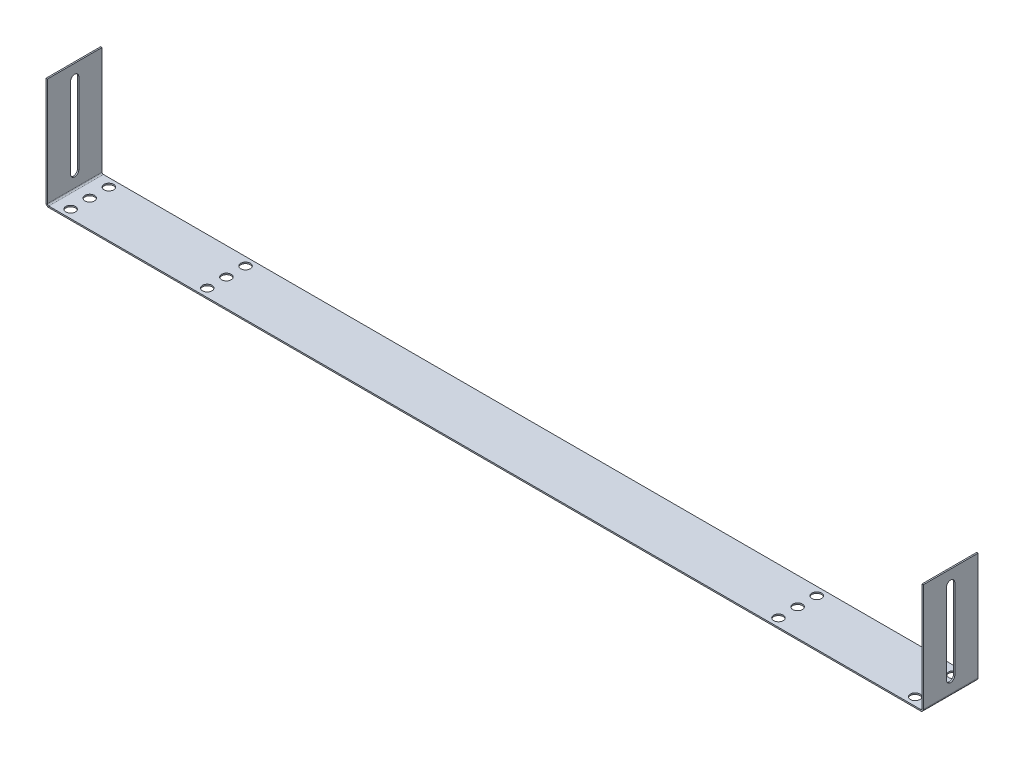
ISO-10303-21;
HEADER;
FILE_DESCRIPTION(('STEP AP214'),'2;1');
FILE_NAME('part.step','',(''),(''),'','','');
FILE_SCHEMA(('AUTOMOTIVE_DESIGN { 1 0 10303 214 1 1 1 1 }'));
ENDSEC;
DATA;
#1=APPLICATION_CONTEXT('core data for automotive mechanical design processes');
#2=APPLICATION_PROTOCOL_DEFINITION('international standard','automotive_design',2000,#1);
#3=PRODUCT_CONTEXT('',#1,'mechanical');
#4=PRODUCT('Part','Part','',(#3));
#5=PRODUCT_RELATED_PRODUCT_CATEGORY('part','',(#4));
#6=PRODUCT_DEFINITION_FORMATION('','',#4);
#7=PRODUCT_DEFINITION_CONTEXT('part definition',#1,'design');
#8=PRODUCT_DEFINITION('design','',#6,#7);
#9=PRODUCT_DEFINITION_SHAPE('','',#8);
#10=(LENGTH_UNIT() NAMED_UNIT(*) SI_UNIT(.MILLI.,.METRE.));
#11=(NAMED_UNIT(*) PLANE_ANGLE_UNIT() SI_UNIT($,.RADIAN.));
#12=(NAMED_UNIT(*) SI_UNIT($,.STERADIAN.) SOLID_ANGLE_UNIT());
#13=UNCERTAINTY_MEASURE_WITH_UNIT(LENGTH_MEASURE(1.E-05),#10,'distance_accuracy_value','');
#14=(GEOMETRIC_REPRESENTATION_CONTEXT(3) GLOBAL_UNCERTAINTY_ASSIGNED_CONTEXT((#13)) GLOBAL_UNIT_ASSIGNED_CONTEXT((#10,
#11,#12)) REPRESENTATION_CONTEXT('',''));
#15=CARTESIAN_POINT('',(0.,0.,0.));
#16=DIRECTION('',(0.,0.,1.));
#17=DIRECTION('',(1.,0.,0.));
#18=AXIS2_PLACEMENT_3D('',#15,#16,#17);
#19=CARTESIAN_POINT('',(1.,0.,40.));
#20=DIRECTION('',(0.,0.,1.));
#21=DIRECTION('',(1.,0.,0.));
#22=AXIS2_PLACEMENT_3D('',#19,#20,#21);
#23=PLANE('',#22);
#24=DIRECTION('',(0.,-1.,0.));
#25=VECTOR('',#24,1.);
#26=CARTESIAN_POINT('',(1.,0.,40.));
#27=LINE('',#26,#25);
#28=CARTESIAN_POINT('',(1.,0.,40.));
#29=VERTEX_POINT('',#28);
#30=CARTESIAN_POINT('',(1.,-1.,40.));
#31=VERTEX_POINT('',#30);
#32=EDGE_CURVE('E11',#29,#31,#27,.T.);
#33=ORIENTED_EDGE('',*,*,#32,.F.);
#34=CARTESIAN_POINT('',(1.,1.,40.));
#35=DIRECTION('',(0.,0.,-1.));
#36=DIRECTION('',(-1.,0.,0.));
#37=AXIS2_PLACEMENT_3D('',#34,#35,#36);
#38=CIRCLE('',#37,1.);
#39=CARTESIAN_POINT('',(0.,1.,40.));
#40=VERTEX_POINT('',#39);
#41=EDGE_CURVE('E257',#40,#29,#38,.F.);
#42=ORIENTED_EDGE('',*,*,#41,.F.);
#43=DIRECTION('',(1.,0.,0.));
#44=VECTOR('',#43,1.);
#45=CARTESIAN_POINT('',(-1.,1.,40.));
#46=LINE('',#45,#44);
#47=CARTESIAN_POINT('',(-1.,1.,40.));
#48=VERTEX_POINT('',#47);
#49=EDGE_CURVE('E45',#48,#40,#46,.T.);
#50=ORIENTED_EDGE('',*,*,#49,.F.);
#51=CARTESIAN_POINT('',(1.,1.,40.));
#52=DIRECTION('',(0.,0.,1.));
#53=DIRECTION('',(1.,0.,0.));
#54=AXIS2_PLACEMENT_3D('',#51,#52,#53);
#55=CIRCLE('',#54,2.);
#56=EDGE_CURVE('E269',#48,#31,#55,.T.);
#57=ORIENTED_EDGE('',*,*,#56,.T.);
#58=EDGE_LOOP('',(#33,#42,#50,#57));
#59=FACE_BOUND('',#58,.T.);
#60=ADVANCED_FACE('F38',(#59),#23,.T.);
#61=CARTESIAN_POINT('',(-1.,1.,40.));
#62=DIRECTION('',(0.,0.,1.));
#63=DIRECTION('',(1.,0.,0.));
#64=AXIS2_PLACEMENT_3D('',#61,#62,#63);
#65=PLANE('',#64);
#66=DIRECTION('',(1.,0.,0.));
#67=VECTOR('',#66,1.);
#68=CARTESIAN_POINT('',(0.,0.,40.));
#69=LINE('',#68,#67);
#70=CARTESIAN_POINT('',(639.,0.,40.));
#71=VERTEX_POINT('',#70);
#72=EDGE_CURVE('E254',#29,#71,#69,.T.);
#73=ORIENTED_EDGE('',*,*,#72,.F.);
#74=ORIENTED_EDGE('',*,*,#32,.T.);
#75=DIRECTION('',(1.,0.,0.));
#76=VECTOR('',#75,1.);
#77=CARTESIAN_POINT('',(0.,-1.,40.));
#78=LINE('',#77,#76);
#79=CARTESIAN_POINT('',(639.,-1.,40.));
#80=VERTEX_POINT('',#79);
#81=EDGE_CURVE('E272',#31,#80,#78,.T.);
#82=ORIENTED_EDGE('',*,*,#81,.T.);
#83=DIRECTION('',(0.,1.,0.));
#84=VECTOR('',#83,1.);
#85=CARTESIAN_POINT('',(639.,-1.,40.));
#86=LINE('',#85,#84);
#87=EDGE_CURVE('E348',#80,#71,#86,.T.);
#88=ORIENTED_EDGE('',*,*,#87,.T.);
#89=EDGE_LOOP('',(#73,#74,#82,#88));
#90=FACE_BOUND('',#89,.T.);
#91=ADVANCED_FACE('F388',(#90),#65,.T.);
#92=CARTESIAN_POINT('',(0.,1.,0.));
#93=DIRECTION('',(0.,0.,-1.));
#94=DIRECTION('',(-1.,0.,0.));
#95=AXIS2_PLACEMENT_3D('',#92,#93,#94);
#96=PLANE('',#95);
#97=DIRECTION('',(-1.,0.,0.));
#98=VECTOR('',#97,1.);
#99=CARTESIAN_POINT('',(0.,1.,0.));
#100=LINE('',#99,#98);
#101=CARTESIAN_POINT('',(0.,1.,0.));
#102=VERTEX_POINT('',#101);
#103=CARTESIAN_POINT('',(-1.,1.,0.));
#104=VERTEX_POINT('',#103);
#105=EDGE_CURVE('E354',#102,#104,#100,.T.);
#106=ORIENTED_EDGE('',*,*,#105,.F.);
#107=CARTESIAN_POINT('',(1.,1.,0.));
#108=DIRECTION('',(0.,0.,-1.));
#109=DIRECTION('',(-1.,0.,0.));
#110=AXIS2_PLACEMENT_3D('',#107,#108,#109);
#111=CIRCLE('',#110,1.);
#112=CARTESIAN_POINT('',(1.,0.,0.));
#113=VERTEX_POINT('',#112);
#114=EDGE_CURVE('E293',#102,#113,#111,.F.);
#115=ORIENTED_EDGE('',*,*,#114,.T.);
#116=DIRECTION('',(0.,1.,0.));
#117=VECTOR('',#116,1.);
#118=CARTESIAN_POINT('',(1.,-1.,0.));
#119=LINE('',#118,#117);
#120=CARTESIAN_POINT('',(1.,-1.,0.));
#121=VERTEX_POINT('',#120);
#122=EDGE_CURVE('E352',#121,#113,#119,.T.);
#123=ORIENTED_EDGE('',*,*,#122,.F.);
#124=CARTESIAN_POINT('',(1.,1.,0.));
#125=DIRECTION('',(0.,0.,1.));
#126=DIRECTION('',(1.,0.,0.));
#127=AXIS2_PLACEMENT_3D('',#124,#125,#126);
#128=CIRCLE('',#127,2.);
#129=EDGE_CURVE('E305',#104,#121,#128,.T.);
#130=ORIENTED_EDGE('',*,*,#129,.F.);
#131=EDGE_LOOP('',(#106,#115,#123,#130));
#132=FACE_BOUND('',#131,.T.);
#133=ADVANCED_FACE('F396',(#132),#96,.T.);
#134=CARTESIAN_POINT('',(1.,-1.,0.));
#135=DIRECTION('',(0.,0.,-1.));
#136=DIRECTION('',(-1.,0.,0.));
#137=AXIS2_PLACEMENT_3D('',#134,#135,#136);
#138=PLANE('',#137);
#139=DIRECTION('',(0.,-1.,0.));
#140=VECTOR('',#139,1.);
#141=CARTESIAN_POINT('',(0.,80.,0.));
#142=LINE('',#141,#140);
#143=CARTESIAN_POINT('',(0.,80.,0.));
#144=VERTEX_POINT('',#143);
#145=EDGE_CURVE('E296',#144,#102,#142,.T.);
#146=ORIENTED_EDGE('',*,*,#145,.T.);
#147=ORIENTED_EDGE('',*,*,#105,.T.);
#148=DIRECTION('',(0.,-1.,0.));
#149=VECTOR('',#148,1.);
#150=CARTESIAN_POINT('',(-1.,80.,0.));
#151=LINE('',#150,#149);
#152=CARTESIAN_POINT('',(-1.,80.,0.));
#153=VERTEX_POINT('',#152);
#154=EDGE_CURVE('E302',#153,#104,#151,.T.);
#155=ORIENTED_EDGE('',*,*,#154,.F.);
#156=DIRECTION('',(1.,0.,0.));
#157=VECTOR('',#156,1.);
#158=CARTESIAN_POINT('',(-1.,80.,0.));
#159=LINE('',#158,#157);
#160=EDGE_CURVE('E299',#153,#144,#159,.T.);
#161=ORIENTED_EDGE('',*,*,#160,.T.);
#162=EDGE_LOOP('',(#146,#147,#155,#161));
#163=FACE_BOUND('',#162,.T.);
#164=ADVANCED_FACE('F398',(#163),#138,.T.);
#165=CARTESIAN_POINT('',(640.,1.,40.));
#166=DIRECTION('',(0.,0.,1.));
#167=DIRECTION('',(1.,0.,0.));
#168=AXIS2_PLACEMENT_3D('',#165,#166,#167);
#169=PLANE('',#168);
#170=DIRECTION('',(1.,0.,0.));
#171=VECTOR('',#170,1.);
#172=CARTESIAN_POINT('',(640.,1.,40.));
#173=LINE('',#172,#171);
#174=CARTESIAN_POINT('',(640.,1.,40.));
#175=VERTEX_POINT('',#174);
#176=CARTESIAN_POINT('',(641.,1.,40.));
#177=VERTEX_POINT('',#176);
#178=EDGE_CURVE('E350',#175,#177,#173,.T.);
#179=ORIENTED_EDGE('',*,*,#178,.F.);
#180=CARTESIAN_POINT('',(639.,1.,40.));
#181=DIRECTION('',(0.,0.,-1.));
#182=DIRECTION('',(-1.,0.,0.));
#183=AXIS2_PLACEMENT_3D('',#180,#181,#182);
#184=CIRCLE('',#183,1.);
#185=EDGE_CURVE('E251',#71,#175,#184,.F.);
#186=ORIENTED_EDGE('',*,*,#185,.F.);
#187=ORIENTED_EDGE('',*,*,#87,.F.);
#188=CARTESIAN_POINT('',(639.,1.,40.));
#189=DIRECTION('',(0.,0.,1.));
#190=DIRECTION('',(1.,0.,0.));
#191=AXIS2_PLACEMENT_3D('',#188,#189,#190);
#192=CIRCLE('',#191,2.);
#193=EDGE_CURVE('E275',#80,#177,#192,.T.);
#194=ORIENTED_EDGE('',*,*,#193,.T.);
#195=EDGE_LOOP('',(#179,#186,#187,#194));
#196=FACE_BOUND('',#195,.T.);
#197=ADVANCED_FACE('F400',(#196),#169,.T.);
#198=CARTESIAN_POINT('',(639.,-1.,40.));
#199=DIRECTION('',(0.,0.,1.));
#200=DIRECTION('',(1.,0.,0.));
#201=AXIS2_PLACEMENT_3D('',#198,#199,#200);
#202=PLANE('',#201);
#203=DIRECTION('',(0.,1.,0.));
#204=VECTOR('',#203,1.);
#205=CARTESIAN_POINT('',(640.,0.,40.));
#206=LINE('',#205,#204);
#207=CARTESIAN_POINT('',(640.,80.,40.));
#208=VERTEX_POINT('',#207);
#209=EDGE_CURVE('E248',#175,#208,#206,.T.);
#210=ORIENTED_EDGE('',*,*,#209,.F.);
#211=ORIENTED_EDGE('',*,*,#178,.T.);
#212=DIRECTION('',(0.,1.,0.));
#213=VECTOR('',#212,1.);
#214=CARTESIAN_POINT('',(641.,0.,40.));
#215=LINE('',#214,#213);
#216=CARTESIAN_POINT('',(641.,80.,40.));
#217=VERTEX_POINT('',#216);
#218=EDGE_CURVE('E242',#177,#217,#215,.T.);
#219=ORIENTED_EDGE('',*,*,#218,.T.);
#220=DIRECTION('',(1.,0.,0.));
#221=VECTOR('',#220,1.);
#222=CARTESIAN_POINT('',(640.,80.,40.));
#223=LINE('',#222,#221);
#224=EDGE_CURVE('E244',#208,#217,#223,.T.);
#225=ORIENTED_EDGE('',*,*,#224,.F.);
#226=EDGE_LOOP('',(#210,#211,#219,#225));
#227=FACE_BOUND('',#226,.T.);
#228=ADVANCED_FACE('F406',(#227),#202,.T.);
#229=CARTESIAN_POINT('',(639.,0.,0.));
#230=DIRECTION('',(0.,0.,-1.));
#231=DIRECTION('',(-1.,0.,0.));
#232=AXIS2_PLACEMENT_3D('',#229,#230,#231);
#233=PLANE('',#232);
#234=DIRECTION('',(0.,-1.,0.));
#235=VECTOR('',#234,1.);
#236=CARTESIAN_POINT('',(639.,0.,0.));
#237=LINE('',#236,#235);
#238=CARTESIAN_POINT('',(639.,0.,0.));
#239=VERTEX_POINT('',#238);
#240=CARTESIAN_POINT('',(639.,-1.,0.));
#241=VERTEX_POINT('',#240);
#242=EDGE_CURVE('E346',#239,#241,#237,.T.);
#243=ORIENTED_EDGE('',*,*,#242,.F.);
#244=CARTESIAN_POINT('',(639.,1.,0.));
#245=DIRECTION('',(0.,0.,-1.));
#246=DIRECTION('',(-1.,0.,0.));
#247=AXIS2_PLACEMENT_3D('',#244,#245,#246);
#248=CIRCLE('',#247,1.);
#249=CARTESIAN_POINT('',(640.,1.,0.));
#250=VERTEX_POINT('',#249);
#251=EDGE_CURVE('E287',#239,#250,#248,.F.);
#252=ORIENTED_EDGE('',*,*,#251,.T.);
#253=DIRECTION('',(-1.,0.,0.));
#254=VECTOR('',#253,1.);
#255=CARTESIAN_POINT('',(641.,1.,0.));
#256=LINE('',#255,#254);
#257=CARTESIAN_POINT('',(641.,1.,0.));
#258=VERTEX_POINT('',#257);
#259=EDGE_CURVE('E344',#258,#250,#256,.T.);
#260=ORIENTED_EDGE('',*,*,#259,.F.);
#261=CARTESIAN_POINT('',(639.,1.,0.));
#262=DIRECTION('',(0.,0.,1.));
#263=DIRECTION('',(1.,0.,0.));
#264=AXIS2_PLACEMENT_3D('',#261,#262,#263);
#265=CIRCLE('',#264,2.);
#266=EDGE_CURVE('E245',#241,#258,#265,.T.);
#267=ORIENTED_EDGE('',*,*,#266,.F.);
#268=EDGE_LOOP('',(#243,#252,#260,#267));
#269=FACE_BOUND('',#268,.T.);
#270=ADVANCED_FACE('F442',(#269),#233,.T.);
#271=CARTESIAN_POINT('',(641.,1.,0.));
#272=DIRECTION('',(0.,0.,-1.));
#273=DIRECTION('',(-1.,0.,0.));
#274=AXIS2_PLACEMENT_3D('',#271,#272,#273);
#275=PLANE('',#274);
#276=DIRECTION('',(1.,0.,0.));
#277=VECTOR('',#276,1.);
#278=CARTESIAN_POINT('',(0.,0.,0.));
#279=LINE('',#278,#277);
#280=EDGE_CURVE('E290',#113,#239,#279,.T.);
#281=ORIENTED_EDGE('',*,*,#280,.T.);
#282=ORIENTED_EDGE('',*,*,#242,.T.);
#283=DIRECTION('',(1.,0.,0.));
#284=VECTOR('',#283,1.);
#285=CARTESIAN_POINT('',(0.,-1.,0.));
#286=LINE('',#285,#284);
#287=EDGE_CURVE('E308',#121,#241,#286,.T.);
#288=ORIENTED_EDGE('',*,*,#287,.F.);
#289=ORIENTED_EDGE('',*,*,#122,.T.);
#290=EDGE_LOOP('',(#281,#282,#288,#289));
#291=FACE_BOUND('',#290,.T.);
#292=ADVANCED_FACE('F453',(#291),#275,.T.);
#293=CARTESIAN_POINT('',(641.,0.,40.));
#294=DIRECTION('',(-1.,0.,0.));
#295=DIRECTION('',(0.,0.,1.));
#296=AXIS2_PLACEMENT_3D('',#293,#294,#295);
#297=PLANE('',#296);
#298=DIRECTION('',(0.,-1.,0.));
#299=VECTOR('',#298,1.);
#300=CARTESIAN_POINT('',(641.,70.,23.));
#301=LINE('',#300,#299);
#302=CARTESIAN_POINT('',(641.,70.,23.));
#303=VERTEX_POINT('',#302);
#304=CARTESIAN_POINT('',(641.,11.,23.));
#305=VERTEX_POINT('',#304);
#306=EDGE_CURVE('E213',#303,#305,#301,.T.);
#307=ORIENTED_EDGE('',*,*,#306,.F.);
#308=CARTESIAN_POINT('',(641.,70.,20.));
#309=DIRECTION('',(1.,0.,0.));
#310=DIRECTION('',(0.,0.,-1.));
#311=AXIS2_PLACEMENT_3D('',#308,#309,#310);
#312=CIRCLE('',#311,3.);
#313=CARTESIAN_POINT('',(641.,70.,17.));
#314=VERTEX_POINT('',#313);
#315=EDGE_CURVE('E52',#314,#303,#312,.T.);
#316=ORIENTED_EDGE('',*,*,#315,.F.);
#317=DIRECTION('',(0.,1.,0.));
#318=VECTOR('',#317,1.);
#319=CARTESIAN_POINT('',(641.,70.,17.));
#320=LINE('',#319,#318);
#321=CARTESIAN_POINT('',(641.,11.,17.));
#322=VERTEX_POINT('',#321);
#323=EDGE_CURVE('E201',#322,#314,#320,.T.);
#324=ORIENTED_EDGE('',*,*,#323,.F.);
#325=CARTESIAN_POINT('',(641.,11.,20.));
#326=DIRECTION('',(1.,0.,0.));
#327=DIRECTION('',(0.,0.,-1.));
#328=AXIS2_PLACEMENT_3D('',#325,#326,#327);
#329=CIRCLE('',#328,3.);
#330=EDGE_CURVE('E204',#305,#322,#329,.T.);
#331=ORIENTED_EDGE('',*,*,#330,.F.);
#332=EDGE_LOOP('',(#307,#316,#324,#331));
#333=FACE_BOUND('',#332,.T.);
#334=DIRECTION('',(0.,1.,0.));
#335=VECTOR('',#334,1.);
#336=CARTESIAN_POINT('',(641.,0.,0.));
#337=LINE('',#336,#335);
#338=CARTESIAN_POINT('',(641.,80.,0.));
#339=VERTEX_POINT('',#338);
#340=EDGE_CURVE('E241',#258,#339,#337,.T.);
#341=ORIENTED_EDGE('',*,*,#340,.T.);
#342=DIRECTION('',(0.,0.,-1.));
#343=VECTOR('',#342,1.);
#344=CARTESIAN_POINT('',(641.,80.,40.));
#345=LINE('',#344,#343);
#346=EDGE_CURVE('E342',#217,#339,#345,.T.);
#347=ORIENTED_EDGE('',*,*,#346,.F.);
#348=ORIENTED_EDGE('',*,*,#218,.F.);
#349=DIRECTION('',(0.,0.,-1.));
#350=VECTOR('',#349,1.);
#351=CARTESIAN_POINT('',(641.,1.,40.));
#352=LINE('',#351,#350);
#353=EDGE_CURVE('E278',#177,#258,#352,.T.);
#354=ORIENTED_EDGE('',*,*,#353,.T.);
#355=EDGE_LOOP('',(#341,#347,#348,#354));
#356=FACE_BOUND('',#355,.T.);
#357=ADVANCED_FACE('F464',(#333,#356),#297,.F.);
#358=CARTESIAN_POINT('',(640.,80.,40.));
#359=DIRECTION('',(0.,1.,0.));
#360=DIRECTION('',(0.,0.,1.));
#361=AXIS2_PLACEMENT_3D('',#358,#359,#360);
#362=PLANE('',#361);
#363=DIRECTION('',(1.,0.,0.));
#364=VECTOR('',#363,1.);
#365=CARTESIAN_POINT('',(640.,80.,0.));
#366=LINE('',#365,#364);
#367=CARTESIAN_POINT('',(640.,80.,0.));
#368=VERTEX_POINT('',#367);
#369=EDGE_CURVE('E281',#368,#339,#366,.T.);
#370=ORIENTED_EDGE('',*,*,#369,.F.);
#371=DIRECTION('',(0.,0.,-1.));
#372=VECTOR('',#371,1.);
#373=CARTESIAN_POINT('',(640.,80.,40.));
#374=LINE('',#373,#372);
#375=EDGE_CURVE('E340',#208,#368,#374,.T.);
#376=ORIENTED_EDGE('',*,*,#375,.F.);
#377=ORIENTED_EDGE('',*,*,#224,.T.);
#378=ORIENTED_EDGE('',*,*,#346,.T.);
#379=EDGE_LOOP('',(#370,#376,#377,#378));
#380=FACE_BOUND('',#379,.T.);
#381=ADVANCED_FACE('F472',(#380),#362,.T.);
#382=CARTESIAN_POINT('',(640.,0.,40.));
#383=DIRECTION('',(-1.,0.,0.));
#384=DIRECTION('',(0.,0.,1.));
#385=AXIS2_PLACEMENT_3D('',#382,#383,#384);
#386=PLANE('',#385);
#387=CARTESIAN_POINT('',(640.,70.,20.));
#388=DIRECTION('',(-1.,0.,0.));
#389=DIRECTION('',(0.,0.,1.));
#390=AXIS2_PLACEMENT_3D('',#387,#388,#389);
#391=CIRCLE('',#390,3.);
#392=CARTESIAN_POINT('',(640.,70.,23.));
#393=VERTEX_POINT('',#392);
#394=CARTESIAN_POINT('',(640.,70.,17.));
#395=VERTEX_POINT('',#394);
#396=EDGE_CURVE('E239',#393,#395,#391,.T.);
#397=ORIENTED_EDGE('',*,*,#396,.F.);
#398=DIRECTION('',(0.,1.,0.));
#399=VECTOR('',#398,1.);
#400=CARTESIAN_POINT('',(640.,0.,23.));
#401=LINE('',#400,#399);
#402=CARTESIAN_POINT('',(640.,11.,23.));
#403=VERTEX_POINT('',#402);
#404=EDGE_CURVE('E228',#403,#393,#401,.T.);
#405=ORIENTED_EDGE('',*,*,#404,.F.);
#406=CARTESIAN_POINT('',(640.,11.,20.));
#407=DIRECTION('',(-1.,0.,0.));
#408=DIRECTION('',(0.,0.,1.));
#409=AXIS2_PLACEMENT_3D('',#406,#407,#408);
#410=CIRCLE('',#409,3.);
#411=CARTESIAN_POINT('',(640.,11.,17.));
#412=VERTEX_POINT('',#411);
#413=EDGE_CURVE('E232',#412,#403,#410,.T.);
#414=ORIENTED_EDGE('',*,*,#413,.F.);
#415=DIRECTION('',(0.,-1.,0.));
#416=VECTOR('',#415,1.);
#417=CARTESIAN_POINT('',(640.,0.,17.));
#418=LINE('',#417,#416);
#419=EDGE_CURVE('E236',#395,#412,#418,.T.);
#420=ORIENTED_EDGE('',*,*,#419,.F.);
#421=EDGE_LOOP('',(#397,#405,#414,#420));
#422=FACE_BOUND('',#421,.T.);
#423=DIRECTION('',(0.,1.,0.));
#424=VECTOR('',#423,1.);
#425=CARTESIAN_POINT('',(640.,0.,0.));
#426=LINE('',#425,#424);
#427=EDGE_CURVE('E284',#250,#368,#426,.T.);
#428=ORIENTED_EDGE('',*,*,#427,.F.);
#429=DIRECTION('',(0.,0.,-1.));
#430=VECTOR('',#429,1.);
#431=CARTESIAN_POINT('',(640.,1.,40.));
#432=LINE('',#431,#430);
#433=EDGE_CURVE('E337',#175,#250,#432,.T.);
#434=ORIENTED_EDGE('',*,*,#433,.F.);
#435=ORIENTED_EDGE('',*,*,#209,.T.);
#436=ORIENTED_EDGE('',*,*,#375,.T.);
#437=EDGE_LOOP('',(#428,#434,#435,#436));
#438=FACE_BOUND('',#437,.T.);
#439=ADVANCED_FACE('F477',(#422,#438),#386,.T.);
#440=CARTESIAN_POINT('',(639.,1.,40.));
#441=DIRECTION('',(0.,0.,-1.));
#442=DIRECTION('',(-1.,0.,0.));
#443=AXIS2_PLACEMENT_3D('',#440,#441,#442);
#444=CYLINDRICAL_SURFACE('',#443,1.);
#445=ORIENTED_EDGE('',*,*,#251,.F.);
#446=DIRECTION('',(0.,0.,-1.));
#447=VECTOR('',#446,1.);
#448=CARTESIAN_POINT('',(639.,0.,40.));
#449=LINE('',#448,#447);
#450=EDGE_CURVE('E334',#71,#239,#449,.T.);
#451=ORIENTED_EDGE('',*,*,#450,.F.);
#452=ORIENTED_EDGE('',*,*,#185,.T.);
#453=ORIENTED_EDGE('',*,*,#433,.T.);
#454=EDGE_LOOP('',(#445,#451,#452,#453));
#455=FACE_BOUND('',#454,.T.);
#456=ADVANCED_FACE('F486',(#455),#444,.F.);
#457=CARTESIAN_POINT('',(0.,0.,40.));
#458=DIRECTION('',(0.,1.,0.));
#459=DIRECTION('',(0.,0.,1.));
#460=AXIS2_PLACEMENT_3D('',#457,#458,#459);
#461=PLANE('',#460);
#462=CARTESIAN_POINT('',(111.,0.,6.));
#463=DIRECTION('',(0.,1.,0.));
#464=DIRECTION('',(0.,0.,1.));
#465=AXIS2_PLACEMENT_3D('',#462,#463,#464);
#466=CIRCLE('',#465,3.49999999999996);
#467=CARTESIAN_POINT('',(111.,0.,9.49999999999996));
#468=VERTEX_POINT('',#467);
#469=EDGE_CURVE('E875',#468,#468,#466,.T.);
#470=ORIENTED_EDGE('',*,*,#469,.F.);
#471=EDGE_LOOP('',(#470));
#472=FACE_BOUND('',#471,.T.);
#473=CARTESIAN_POINT('',(111.,0.,20.));
#474=DIRECTION('',(0.,1.,0.));
#475=DIRECTION('',(0.,0.,1.));
#476=AXIS2_PLACEMENT_3D('',#473,#474,#475);
#477=CIRCLE('',#476,3.49999999999996);
#478=CARTESIAN_POINT('',(111.,0.,23.5));
#479=VERTEX_POINT('',#478);
#480=EDGE_CURVE('E878',#479,#479,#477,.T.);
#481=ORIENTED_EDGE('',*,*,#480,.F.);
#482=EDGE_LOOP('',(#481));
#483=FACE_BOUND('',#482,.T.);
#484=CARTESIAN_POINT('',(111.,0.,34.));
#485=DIRECTION('',(0.,1.,0.));
#486=DIRECTION('',(0.,0.,-1.));
#487=AXIS2_PLACEMENT_3D('',#484,#485,#486);
#488=CIRCLE('',#487,3.49999999999996);
#489=CARTESIAN_POINT('',(111.,0.,30.5));
#490=VERTEX_POINT('',#489);
#491=EDGE_CURVE('E949',#490,#490,#488,.T.);
#492=ORIENTED_EDGE('',*,*,#491,.F.);
#493=EDGE_LOOP('',(#492));
#494=FACE_BOUND('',#493,.T.);
#495=CARTESIAN_POINT('',(629.,0.,34.));
#496=DIRECTION('',(0.,1.,0.));
#497=DIRECTION('',(0.,0.,-1.));
#498=AXIS2_PLACEMENT_3D('',#495,#496,#497);
#499=CIRCLE('',#498,3.49999999999996);
#500=CARTESIAN_POINT('',(629.,0.,30.5));
#501=VERTEX_POINT('',#500);
#502=EDGE_CURVE('E943',#501,#501,#499,.T.);
#503=ORIENTED_EDGE('',*,*,#502,.F.);
#504=EDGE_LOOP('',(#503));
#505=FACE_BOUND('',#504,.T.);
#506=CARTESIAN_POINT('',(629.,0.,6.));
#507=DIRECTION('',(0.,1.,0.));
#508=DIRECTION('',(0.,0.,1.));
#509=AXIS2_PLACEMENT_3D('',#506,#507,#508);
#510=CIRCLE('',#509,3.49999999999996);
#511=CARTESIAN_POINT('',(629.,0.,9.49999999999996));
#512=VERTEX_POINT('',#511);
#513=EDGE_CURVE('E902',#512,#512,#510,.T.);
#514=ORIENTED_EDGE('',*,*,#513,.F.);
#515=EDGE_LOOP('',(#514));
#516=FACE_BOUND('',#515,.T.);
#517=CARTESIAN_POINT('',(11.,0.,20.));
#518=DIRECTION('',(0.,1.,0.));
#519=DIRECTION('',(0.,0.,-1.));
#520=AXIS2_PLACEMENT_3D('',#517,#518,#519);
#521=CIRCLE('',#520,3.49999999999996);
#522=CARTESIAN_POINT('',(11.,0.,16.5));
#523=VERTEX_POINT('',#522);
#524=EDGE_CURVE('E888',#523,#523,#521,.T.);
#525=ORIENTED_EDGE('',*,*,#524,.F.);
#526=EDGE_LOOP('',(#525));
#527=FACE_BOUND('',#526,.T.);
#528=CARTESIAN_POINT('',(11.,0.,6.));
#529=DIRECTION('',(0.,1.,0.));
#530=DIRECTION('',(0.,0.,-1.));
#531=AXIS2_PLACEMENT_3D('',#528,#529,#530);
#532=CIRCLE('',#531,3.49999999999996);
#533=CARTESIAN_POINT('',(11.,0.,2.50000000000004));
#534=VERTEX_POINT('',#533);
#535=EDGE_CURVE('E889',#534,#534,#532,.T.);
#536=ORIENTED_EDGE('',*,*,#535,.F.);
#537=EDGE_LOOP('',(#536));
#538=FACE_BOUND('',#537,.T.);
#539=CARTESIAN_POINT('',(11.,0.,34.));
#540=DIRECTION('',(0.,1.,0.));
#541=DIRECTION('',(0.,0.,1.));
#542=AXIS2_PLACEMENT_3D('',#539,#540,#541);
#543=CIRCLE('',#542,3.49999999999996);
#544=CARTESIAN_POINT('',(11.,0.,37.5));
#545=VERTEX_POINT('',#544);
#546=EDGE_CURVE('E895',#545,#545,#543,.T.);
#547=ORIENTED_EDGE('',*,*,#546,.F.);
#548=EDGE_LOOP('',(#547));
#549=FACE_BOUND('',#548,.T.);
#550=CARTESIAN_POINT('',(529.,0.,20.));
#551=DIRECTION('',(0.,1.,0.));
#552=DIRECTION('',(0.,0.,-1.));
#553=AXIS2_PLACEMENT_3D('',#550,#551,#552);
#554=CIRCLE('',#553,3.49999999999996);
#555=CARTESIAN_POINT('',(529.,0.,16.5));
#556=VERTEX_POINT('',#555);
#557=EDGE_CURVE('E881',#556,#556,#554,.T.);
#558=ORIENTED_EDGE('',*,*,#557,.F.);
#559=EDGE_LOOP('',(#558));
#560=FACE_BOUND('',#559,.T.);
#561=CARTESIAN_POINT('',(529.,0.,34.));
#562=DIRECTION('',(0.,1.,0.));
#563=DIRECTION('',(0.,0.,1.));
#564=AXIS2_PLACEMENT_3D('',#561,#562,#563);
#565=CIRCLE('',#564,3.49999999999996);
#566=CARTESIAN_POINT('',(529.,0.,37.5));
#567=VERTEX_POINT('',#566);
#568=EDGE_CURVE('E930',#567,#567,#565,.T.);
#569=ORIENTED_EDGE('',*,*,#568,.F.);
#570=EDGE_LOOP('',(#569));
#571=FACE_BOUND('',#570,.T.);
#572=CARTESIAN_POINT('',(529.,0.,6.));
#573=DIRECTION('',(0.,1.,0.));
#574=DIRECTION('',(0.,0.,-1.));
#575=AXIS2_PLACEMENT_3D('',#572,#573,#574);
#576=CIRCLE('',#575,3.49999999999996);
#577=CARTESIAN_POINT('',(529.,0.,2.50000000000004));
#578=VERTEX_POINT('',#577);
#579=EDGE_CURVE('E933',#578,#578,#576,.T.);
#580=ORIENTED_EDGE('',*,*,#579,.F.);
#581=EDGE_LOOP('',(#580));
#582=FACE_BOUND('',#581,.T.);
#583=CARTESIAN_POINT('',(629.,0.,20.));
#584=DIRECTION('',(0.,1.,0.));
#585=DIRECTION('',(0.,0.,1.));
#586=AXIS2_PLACEMENT_3D('',#583,#584,#585);
#587=CIRCLE('',#586,3.49999999999996);
#588=CARTESIAN_POINT('',(629.,0.,23.5));
#589=VERTEX_POINT('',#588);
#590=EDGE_CURVE('E207',#589,#589,#587,.T.);
#591=ORIENTED_EDGE('',*,*,#590,.F.);
#592=EDGE_LOOP('',(#591));
#593=FACE_BOUND('',#592,.T.);
#594=ORIENTED_EDGE('',*,*,#280,.F.);
#595=DIRECTION('',(0.,0.,-1.));
#596=VECTOR('',#595,1.);
#597=CARTESIAN_POINT('',(1.,0.,40.));
#598=LINE('',#597,#596);
#599=EDGE_CURVE('E331',#29,#113,#598,.T.);
#600=ORIENTED_EDGE('',*,*,#599,.F.);
#601=ORIENTED_EDGE('',*,*,#72,.T.);
#602=ORIENTED_EDGE('',*,*,#450,.T.);
#603=EDGE_LOOP('',(#594,#600,#601,#602));
#604=FACE_BOUND('',#603,.T.);
#605=ADVANCED_FACE('F392',(#472,#483,#494,#505,#516,#527,#538,#549,#560,#571,#582,#593,#604),
#461,.T.);
#606=CARTESIAN_POINT('',(1.,1.,40.));
#607=DIRECTION('',(0.,0.,-1.));
#608=DIRECTION('',(-1.,0.,0.));
#609=AXIS2_PLACEMENT_3D('',#606,#607,#608);
#610=CYLINDRICAL_SURFACE('',#609,1.);
#611=ORIENTED_EDGE('',*,*,#114,.F.);
#612=DIRECTION('',(0.,0.,-1.));
#613=VECTOR('',#612,1.);
#614=CARTESIAN_POINT('',(0.,1.,40.));
#615=LINE('',#614,#613);
#616=EDGE_CURVE('E328',#40,#102,#615,.T.);
#617=ORIENTED_EDGE('',*,*,#616,.F.);
#618=ORIENTED_EDGE('',*,*,#41,.T.);
#619=ORIENTED_EDGE('',*,*,#599,.T.);
#620=EDGE_LOOP('',(#611,#617,#618,#619));
#621=FACE_BOUND('',#620,.T.);
#622=ADVANCED_FACE('F366',(#621),#610,.F.);
#623=CARTESIAN_POINT('',(0.,80.,40.));
#624=DIRECTION('',(1.,0.,0.));
#625=DIRECTION('',(0.,1.,0.));
#626=AXIS2_PLACEMENT_3D('',#623,#624,#625);
#627=PLANE('',#626);
#628=CARTESIAN_POINT('',(0.,70.,20.));
#629=DIRECTION('',(1.,0.,0.));
#630=DIRECTION('',(0.,1.,0.));
#631=AXIS2_PLACEMENT_3D('',#628,#629,#630);
#632=CIRCLE('',#631,3.);
#633=CARTESIAN_POINT('',(0.,70.,17.));
#634=VERTEX_POINT('',#633);
#635=CARTESIAN_POINT('',(0.,70.,23.));
#636=VERTEX_POINT('',#635);
#637=EDGE_CURVE('E182',#634,#636,#632,.T.);
#638=ORIENTED_EDGE('',*,*,#637,.F.);
#639=DIRECTION('',(0.,1.,0.));
#640=VECTOR('',#639,1.);
#641=CARTESIAN_POINT('',(0.,80.,17.));
#642=LINE('',#641,#640);
#643=CARTESIAN_POINT('',(0.,11.,17.));
#644=VERTEX_POINT('',#643);
#645=EDGE_CURVE('E234',#644,#634,#642,.T.);
#646=ORIENTED_EDGE('',*,*,#645,.F.);
#647=CARTESIAN_POINT('',(0.,11.,20.));
#648=DIRECTION('',(1.,0.,0.));
#649=DIRECTION('',(0.,1.,0.));
#650=AXIS2_PLACEMENT_3D('',#647,#648,#649);
#651=CIRCLE('',#650,3.);
#652=CARTESIAN_POINT('',(0.,11.,23.));
#653=VERTEX_POINT('',#652);
#654=EDGE_CURVE('E230',#653,#644,#651,.T.);
#655=ORIENTED_EDGE('',*,*,#654,.F.);
#656=DIRECTION('',(0.,-1.,0.));
#657=VECTOR('',#656,1.);
#658=CARTESIAN_POINT('',(0.,80.,23.));
#659=LINE('',#658,#657);
#660=EDGE_CURVE('E220',#636,#653,#659,.T.);
#661=ORIENTED_EDGE('',*,*,#660,.F.);
#662=EDGE_LOOP('',(#638,#646,#655,#661));
#663=FACE_BOUND('',#662,.T.);
#664=ORIENTED_EDGE('',*,*,#145,.F.);
#665=DIRECTION('',(0.,0.,-1.));
#666=VECTOR('',#665,1.);
#667=CARTESIAN_POINT('',(0.,80.,40.));
#668=LINE('',#667,#666);
#669=CARTESIAN_POINT('',(0.,80.,40.));
#670=VERTEX_POINT('',#669);
#671=EDGE_CURVE('E326',#670,#144,#668,.T.);
#672=ORIENTED_EDGE('',*,*,#671,.F.);
#673=DIRECTION('',(0.,-1.,0.));
#674=VECTOR('',#673,1.);
#675=CARTESIAN_POINT('',(0.,80.,40.));
#676=LINE('',#675,#674);
#677=EDGE_CURVE('E260',#670,#40,#676,.T.);
#678=ORIENTED_EDGE('',*,*,#677,.T.);
#679=ORIENTED_EDGE('',*,*,#616,.T.);
#680=EDGE_LOOP('',(#664,#672,#678,#679));
#681=FACE_BOUND('',#680,.T.);
#682=ADVANCED_FACE('F370',(#663,#681),#627,.T.);
#683=CARTESIAN_POINT('',(-1.,80.,40.));
#684=DIRECTION('',(0.,1.,0.));
#685=DIRECTION('',(0.,0.,1.));
#686=AXIS2_PLACEMENT_3D('',#683,#684,#685);
#687=PLANE('',#686);
#688=ORIENTED_EDGE('',*,*,#160,.F.);
#689=DIRECTION('',(0.,0.,-1.));
#690=VECTOR('',#689,1.);
#691=CARTESIAN_POINT('',(-1.,80.,40.));
#692=LINE('',#691,#690);
#693=CARTESIAN_POINT('',(-1.,80.,40.));
#694=VERTEX_POINT('',#693);
#695=EDGE_CURVE('E324',#694,#153,#692,.T.);
#696=ORIENTED_EDGE('',*,*,#695,.F.);
#697=DIRECTION('',(1.,0.,0.));
#698=VECTOR('',#697,1.);
#699=CARTESIAN_POINT('',(-1.,80.,40.));
#700=LINE('',#699,#698);
#701=EDGE_CURVE('E263',#694,#670,#700,.T.);
#702=ORIENTED_EDGE('',*,*,#701,.T.);
#703=ORIENTED_EDGE('',*,*,#671,.T.);
#704=EDGE_LOOP('',(#688,#696,#702,#703));
#705=FACE_BOUND('',#704,.T.);
#706=ADVANCED_FACE('F373',(#705),#687,.T.);
#707=CARTESIAN_POINT('',(-1.,80.,40.));
#708=DIRECTION('',(1.,0.,0.));
#709=DIRECTION('',(0.,1.,0.));
#710=AXIS2_PLACEMENT_3D('',#707,#708,#709);
#711=PLANE('',#710);
#712=DIRECTION('',(0.,1.,0.));
#713=VECTOR('',#712,1.);
#714=CARTESIAN_POINT('',(-1.,70.,17.));
#715=LINE('',#714,#713);
#716=CARTESIAN_POINT('',(-1.,11.,17.));
#717=VERTEX_POINT('',#716);
#718=CARTESIAN_POINT('',(-1.,70.,17.));
#719=VERTEX_POINT('',#718);
#720=EDGE_CURVE('E200',#717,#719,#715,.T.);
#721=ORIENTED_EDGE('',*,*,#720,.T.);
#722=CARTESIAN_POINT('',(-1.,70.,20.));
#723=DIRECTION('',(1.,0.,0.));
#724=DIRECTION('',(0.,0.,-1.));
#725=AXIS2_PLACEMENT_3D('',#722,#723,#724);
#726=CIRCLE('',#725,3.);
#727=CARTESIAN_POINT('',(-1.,70.,23.));
#728=VERTEX_POINT('',#727);
#729=EDGE_CURVE('E179',#719,#728,#726,.T.);
#730=ORIENTED_EDGE('',*,*,#729,.T.);
#731=DIRECTION('',(0.,-1.,0.));
#732=VECTOR('',#731,1.);
#733=CARTESIAN_POINT('',(-1.,70.,23.));
#734=LINE('',#733,#732);
#735=CARTESIAN_POINT('',(-1.,11.,23.));
#736=VERTEX_POINT('',#735);
#737=EDGE_CURVE('E189',#728,#736,#734,.T.);
#738=ORIENTED_EDGE('',*,*,#737,.T.);
#739=CARTESIAN_POINT('',(-1.,11.,20.));
#740=DIRECTION('',(1.,0.,0.));
#741=DIRECTION('',(0.,0.,-1.));
#742=AXIS2_PLACEMENT_3D('',#739,#740,#741);
#743=CIRCLE('',#742,3.);
#744=EDGE_CURVE('E195',#736,#717,#743,.T.);
#745=ORIENTED_EDGE('',*,*,#744,.T.);
#746=EDGE_LOOP('',(#721,#730,#738,#745));
#747=FACE_BOUND('',#746,.T.);
#748=ORIENTED_EDGE('',*,*,#154,.T.);
#749=DIRECTION('',(0.,0.,-1.));
#750=VECTOR('',#749,1.);
#751=CARTESIAN_POINT('',(-1.,1.,40.));
#752=LINE('',#751,#750);
#753=EDGE_CURVE('E321',#48,#104,#752,.T.);
#754=ORIENTED_EDGE('',*,*,#753,.F.);
#755=DIRECTION('',(0.,-1.,0.));
#756=VECTOR('',#755,1.);
#757=CARTESIAN_POINT('',(-1.,80.,40.));
#758=LINE('',#757,#756);
#759=EDGE_CURVE('E266',#694,#48,#758,.T.);
#760=ORIENTED_EDGE('',*,*,#759,.F.);
#761=ORIENTED_EDGE('',*,*,#695,.T.);
#762=EDGE_LOOP('',(#748,#754,#760,#761));
#763=FACE_BOUND('',#762,.T.);
#764=ADVANCED_FACE('F197',(#747,#763),#711,.F.);
#765=CARTESIAN_POINT('',(1.,1.,40.));
#766=DIRECTION('',(0.,0.,-1.));
#767=DIRECTION('',(-1.,0.,0.));
#768=AXIS2_PLACEMENT_3D('',#765,#766,#767);
#769=CYLINDRICAL_SURFACE('',#768,2.);
#770=ORIENTED_EDGE('',*,*,#129,.T.);
#771=DIRECTION('',(0.,0.,-1.));
#772=VECTOR('',#771,1.);
#773=CARTESIAN_POINT('',(1.,-1.,40.));
#774=LINE('',#773,#772);
#775=EDGE_CURVE('E318',#31,#121,#774,.T.);
#776=ORIENTED_EDGE('',*,*,#775,.F.);
#777=ORIENTED_EDGE('',*,*,#56,.F.);
#778=ORIENTED_EDGE('',*,*,#753,.T.);
#779=EDGE_LOOP('',(#770,#776,#777,#778));
#780=FACE_BOUND('',#779,.T.);
#781=ADVANCED_FACE('F379',(#780),#769,.T.);
#782=CARTESIAN_POINT('',(0.,-1.,40.));
#783=DIRECTION('',(0.,1.,0.));
#784=DIRECTION('',(0.,0.,1.));
#785=AXIS2_PLACEMENT_3D('',#782,#783,#784);
#786=PLANE('',#785);
#787=CARTESIAN_POINT('',(111.,-1.,6.));
#788=DIRECTION('',(0.,1.,0.));
#789=DIRECTION('',(0.,0.,1.));
#790=AXIS2_PLACEMENT_3D('',#787,#788,#789);
#791=CIRCLE('',#790,3.49999999999996);
#792=CARTESIAN_POINT('',(111.,-1.,9.49999999999996));
#793=VERTEX_POINT('',#792);
#794=EDGE_CURVE('E872',#793,#793,#791,.T.);
#795=ORIENTED_EDGE('',*,*,#794,.T.);
#796=EDGE_LOOP('',(#795));
#797=FACE_BOUND('',#796,.T.);
#798=CARTESIAN_POINT('',(111.,-1.,20.));
#799=DIRECTION('',(0.,1.,0.));
#800=DIRECTION('',(0.,0.,1.));
#801=AXIS2_PLACEMENT_3D('',#798,#799,#800);
#802=CIRCLE('',#801,3.49999999999996);
#803=CARTESIAN_POINT('',(111.,-1.,23.5));
#804=VERTEX_POINT('',#803);
#805=EDGE_CURVE('E952',#804,#804,#802,.T.);
#806=ORIENTED_EDGE('',*,*,#805,.T.);
#807=EDGE_LOOP('',(#806));
#808=FACE_BOUND('',#807,.T.);
#809=CARTESIAN_POINT('',(111.,-1.,34.));
#810=DIRECTION('',(0.,1.,0.));
#811=DIRECTION('',(0.,0.,-1.));
#812=AXIS2_PLACEMENT_3D('',#809,#810,#811);
#813=CIRCLE('',#812,3.49999999999996);
#814=CARTESIAN_POINT('',(111.,-1.,30.5));
#815=VERTEX_POINT('',#814);
#816=EDGE_CURVE('E946',#815,#815,#813,.T.);
#817=ORIENTED_EDGE('',*,*,#816,.T.);
#818=EDGE_LOOP('',(#817));
#819=FACE_BOUND('',#818,.T.);
#820=CARTESIAN_POINT('',(629.,-1.,34.));
#821=DIRECTION('',(0.,1.,0.));
#822=DIRECTION('',(0.,0.,-1.));
#823=AXIS2_PLACEMENT_3D('',#820,#821,#822);
#824=CIRCLE('',#823,3.49999999999996);
#825=CARTESIAN_POINT('',(629.,-1.,30.5));
#826=VERTEX_POINT('',#825);
#827=EDGE_CURVE('E898',#826,#826,#824,.T.);
#828=ORIENTED_EDGE('',*,*,#827,.T.);
#829=EDGE_LOOP('',(#828));
#830=FACE_BOUND('',#829,.T.);
#831=CARTESIAN_POINT('',(629.,-1.,6.));
#832=DIRECTION('',(0.,1.,0.));
#833=DIRECTION('',(0.,0.,1.));
#834=AXIS2_PLACEMENT_3D('',#831,#832,#833);
#835=CIRCLE('',#834,3.49999999999996);
#836=CARTESIAN_POINT('',(629.,-1.,9.49999999999996));
#837=VERTEX_POINT('',#836);
#838=EDGE_CURVE('E899',#837,#837,#835,.T.);
#839=ORIENTED_EDGE('',*,*,#838,.T.);
#840=EDGE_LOOP('',(#839));
#841=FACE_BOUND('',#840,.T.);
#842=CARTESIAN_POINT('',(11.,-1.,20.));
#843=DIRECTION('',(0.,1.,0.));
#844=DIRECTION('',(0.,0.,-1.));
#845=AXIS2_PLACEMENT_3D('',#842,#843,#844);
#846=CIRCLE('',#845,3.49999999999996);
#847=CARTESIAN_POINT('',(11.,-1.,16.5));
#848=VERTEX_POINT('',#847);
#849=EDGE_CURVE('E905',#848,#848,#846,.T.);
#850=ORIENTED_EDGE('',*,*,#849,.T.);
#851=EDGE_LOOP('',(#850));
#852=FACE_BOUND('',#851,.T.);
#853=CARTESIAN_POINT('',(11.,-1.,6.));
#854=DIRECTION('',(0.,1.,0.));
#855=DIRECTION('',(0.,0.,-1.));
#856=AXIS2_PLACEMENT_3D('',#853,#854,#855);
#857=CIRCLE('',#856,3.49999999999996);
#858=CARTESIAN_POINT('',(11.,-1.,2.50000000000004));
#859=VERTEX_POINT('',#858);
#860=EDGE_CURVE('E885',#859,#859,#857,.T.);
#861=ORIENTED_EDGE('',*,*,#860,.T.);
#862=EDGE_LOOP('',(#861));
#863=FACE_BOUND('',#862,.T.);
#864=CARTESIAN_POINT('',(11.,-1.,34.));
#865=DIRECTION('',(0.,1.,0.));
#866=DIRECTION('',(0.,0.,1.));
#867=AXIS2_PLACEMENT_3D('',#864,#865,#866);
#868=CIRCLE('',#867,3.49999999999996);
#869=CARTESIAN_POINT('',(11.,-1.,37.5));
#870=VERTEX_POINT('',#869);
#871=EDGE_CURVE('E892',#870,#870,#868,.T.);
#872=ORIENTED_EDGE('',*,*,#871,.T.);
#873=EDGE_LOOP('',(#872));
#874=FACE_BOUND('',#873,.T.);
#875=CARTESIAN_POINT('',(529.,-1.,20.));
#876=DIRECTION('',(0.,1.,0.));
#877=DIRECTION('',(0.,0.,-1.));
#878=AXIS2_PLACEMENT_3D('',#875,#876,#877);
#879=CIRCLE('',#878,3.49999999999996);
#880=CARTESIAN_POINT('',(529.,-1.,16.5));
#881=VERTEX_POINT('',#880);
#882=EDGE_CURVE('E876',#881,#881,#879,.T.);
#883=ORIENTED_EDGE('',*,*,#882,.T.);
#884=EDGE_LOOP('',(#883));
#885=FACE_BOUND('',#884,.T.);
#886=CARTESIAN_POINT('',(529.,-1.,34.));
#887=DIRECTION('',(0.,1.,0.));
#888=DIRECTION('',(0.,0.,1.));
#889=AXIS2_PLACEMENT_3D('',#886,#887,#888);
#890=CIRCLE('',#889,3.49999999999996);
#891=CARTESIAN_POINT('',(529.,-1.,37.5));
#892=VERTEX_POINT('',#891);
#893=EDGE_CURVE('E987',#892,#892,#890,.T.);
#894=ORIENTED_EDGE('',*,*,#893,.T.);
#895=EDGE_LOOP('',(#894));
#896=FACE_BOUND('',#895,.T.);
#897=CARTESIAN_POINT('',(529.,-1.,6.));
#898=DIRECTION('',(0.,1.,0.));
#899=DIRECTION('',(0.,0.,-1.));
#900=AXIS2_PLACEMENT_3D('',#897,#898,#899);
#901=CIRCLE('',#900,3.49999999999996);
#902=CARTESIAN_POINT('',(529.,-1.,2.50000000000004));
#903=VERTEX_POINT('',#902);
#904=EDGE_CURVE('E935',#903,#903,#901,.T.);
#905=ORIENTED_EDGE('',*,*,#904,.T.);
#906=EDGE_LOOP('',(#905));
#907=FACE_BOUND('',#906,.T.);
#908=CARTESIAN_POINT('',(629.,-1.,20.));
#909=DIRECTION('',(0.,1.,0.));
#910=DIRECTION('',(0.,0.,1.));
#911=AXIS2_PLACEMENT_3D('',#908,#909,#910);
#912=CIRCLE('',#911,3.49999999999996);
#913=CARTESIAN_POINT('',(629.,-1.,23.5));
#914=VERTEX_POINT('',#913);
#915=EDGE_CURVE('E214',#914,#914,#912,.T.);
#916=ORIENTED_EDGE('',*,*,#915,.T.);
#917=EDGE_LOOP('',(#916));
#918=FACE_BOUND('',#917,.T.);
#919=ORIENTED_EDGE('',*,*,#287,.T.);
#920=DIRECTION('',(0.,0.,-1.));
#921=VECTOR('',#920,1.);
#922=CARTESIAN_POINT('',(639.,-1.,40.));
#923=LINE('',#922,#921);
#924=EDGE_CURVE('E315',#80,#241,#923,.T.);
#925=ORIENTED_EDGE('',*,*,#924,.F.);
#926=ORIENTED_EDGE('',*,*,#81,.F.);
#927=ORIENTED_EDGE('',*,*,#775,.T.);
#928=EDGE_LOOP('',(#919,#925,#926,#927));
#929=FACE_BOUND('',#928,.T.);
#930=ADVANCED_FACE('F384',(#797,#808,#819,#830,#841,#852,#863,#874,#885,#896,#907,#918,#929),
#786,.F.);
#931=CARTESIAN_POINT('',(639.,1.,40.));
#932=DIRECTION('',(0.,0.,-1.));
#933=DIRECTION('',(-1.,0.,0.));
#934=AXIS2_PLACEMENT_3D('',#931,#932,#933);
#935=CYLINDRICAL_SURFACE('',#934,2.);
#936=ORIENTED_EDGE('',*,*,#266,.T.);
#937=ORIENTED_EDGE('',*,*,#353,.F.);
#938=ORIENTED_EDGE('',*,*,#193,.F.);
#939=ORIENTED_EDGE('',*,*,#924,.T.);
#940=EDGE_LOOP('',(#936,#937,#938,#939));
#941=FACE_BOUND('',#940,.T.);
#942=ADVANCED_FACE('F532',(#941),#935,.T.);
#943=CARTESIAN_POINT('',(639.,1.,40.));
#944=DIRECTION('',(0.,0.,-1.));
#945=DIRECTION('',(-1.,0.,0.));
#946=AXIS2_PLACEMENT_3D('',#943,#944,#945);
#947=PLANE('',#946);
#948=ORIENTED_EDGE('',*,*,#759,.T.);
#949=ORIENTED_EDGE('',*,*,#49,.T.);
#950=ORIENTED_EDGE('',*,*,#677,.F.);
#951=ORIENTED_EDGE('',*,*,#701,.F.);
#952=EDGE_LOOP('',(#948,#949,#950,#951));
#953=FACE_BOUND('',#952,.T.);
#954=ADVANCED_FACE('F358',(#953),#947,.F.);
#955=CARTESIAN_POINT('',(639.,1.,0.));
#956=DIRECTION('',(0.,0.,-1.));
#957=DIRECTION('',(-1.,0.,0.));
#958=AXIS2_PLACEMENT_3D('',#955,#956,#957);
#959=PLANE('',#958);
#960=ORIENTED_EDGE('',*,*,#340,.F.);
#961=ORIENTED_EDGE('',*,*,#259,.T.);
#962=ORIENTED_EDGE('',*,*,#427,.T.);
#963=ORIENTED_EDGE('',*,*,#369,.T.);
#964=EDGE_LOOP('',(#960,#961,#962,#963));
#965=FACE_BOUND('',#964,.T.);
#966=ADVANCED_FACE('F547',(#965),#959,.T.);
#967=CARTESIAN_POINT('',(-1.,70.,23.));
#968=DIRECTION('',(0.,0.,1.));
#969=DIRECTION('',(0.,-1.,0.));
#970=AXIS2_PLACEMENT_3D('',#967,#968,#969);
#971=PLANE('',#970);
#972=ORIENTED_EDGE('',*,*,#660,.T.);
#973=DIRECTION('',(1.,0.,0.));
#974=VECTOR('',#973,1.);
#975=CARTESIAN_POINT('',(-1.,11.,23.));
#976=LINE('',#975,#974);
#977=EDGE_CURVE('E192',#736,#653,#976,.T.);
#978=ORIENTED_EDGE('',*,*,#977,.F.);
#979=ORIENTED_EDGE('',*,*,#737,.F.);
#980=DIRECTION('',(1.,0.,0.));
#981=VECTOR('',#980,1.);
#982=CARTESIAN_POINT('',(-1.,70.,23.));
#983=LINE('',#982,#981);
#984=EDGE_CURVE('E174',#728,#636,#983,.T.);
#985=ORIENTED_EDGE('',*,*,#984,.T.);
#986=EDGE_LOOP('',(#972,#978,#979,#985));
#987=FACE_BOUND('',#986,.T.);
#988=ADVANCED_FACE('F190',(#987),#971,.F.);
#989=CARTESIAN_POINT('',(-1.,11.,20.));
#990=DIRECTION('',(1.,0.,0.));
#991=DIRECTION('',(0.,0.,-1.));
#992=AXIS2_PLACEMENT_3D('',#989,#990,#991);
#993=CYLINDRICAL_SURFACE('',#992,3.);
#994=ORIENTED_EDGE('',*,*,#654,.T.);
#995=DIRECTION('',(1.,0.,0.));
#996=VECTOR('',#995,1.);
#997=CARTESIAN_POINT('',(-1.,11.,17.));
#998=LINE('',#997,#996);
#999=EDGE_CURVE('E222',#717,#644,#998,.T.);
#1000=ORIENTED_EDGE('',*,*,#999,.F.);
#1001=ORIENTED_EDGE('',*,*,#744,.F.);
#1002=ORIENTED_EDGE('',*,*,#977,.T.);
#1003=EDGE_LOOP('',(#994,#1000,#1001,#1002));
#1004=FACE_BOUND('',#1003,.T.);
#1005=ADVANCED_FACE('F598',(#1004),#993,.F.);
#1006=CARTESIAN_POINT('',(-1.,70.,17.));
#1007=DIRECTION('',(0.,0.,-1.));
#1008=DIRECTION('',(0.,1.,0.));
#1009=AXIS2_PLACEMENT_3D('',#1006,#1007,#1008);
#1010=PLANE('',#1009);
#1011=ORIENTED_EDGE('',*,*,#645,.T.);
#1012=DIRECTION('',(1.,0.,0.));
#1013=VECTOR('',#1012,1.);
#1014=CARTESIAN_POINT('',(-1.,70.,17.));
#1015=LINE('',#1014,#1013);
#1016=EDGE_CURVE('E218',#719,#634,#1015,.T.);
#1017=ORIENTED_EDGE('',*,*,#1016,.F.);
#1018=ORIENTED_EDGE('',*,*,#720,.F.);
#1019=ORIENTED_EDGE('',*,*,#999,.T.);
#1020=EDGE_LOOP('',(#1011,#1017,#1018,#1019));
#1021=FACE_BOUND('',#1020,.T.);
#1022=ADVANCED_FACE('F609',(#1021),#1010,.F.);
#1023=CARTESIAN_POINT('',(-1.,70.,20.));
#1024=DIRECTION('',(1.,0.,0.));
#1025=DIRECTION('',(0.,0.,-1.));
#1026=AXIS2_PLACEMENT_3D('',#1023,#1024,#1025);
#1027=CYLINDRICAL_SURFACE('',#1026,3.);
#1028=ORIENTED_EDGE('',*,*,#637,.T.);
#1029=ORIENTED_EDGE('',*,*,#984,.F.);
#1030=ORIENTED_EDGE('',*,*,#729,.F.);
#1031=ORIENTED_EDGE('',*,*,#1016,.T.);
#1032=EDGE_LOOP('',(#1028,#1029,#1030,#1031));
#1033=FACE_BOUND('',#1032,.T.);
#1034=ADVANCED_FACE('F176',(#1033),#1027,.F.);
#1035=ORIENTED_EDGE('',*,*,#396,.T.);
#1036=EDGE_CURVE('E221',#395,#314,#1015,.T.);
#1037=ORIENTED_EDGE('',*,*,#1036,.T.);
#1038=ORIENTED_EDGE('',*,*,#315,.T.);
#1039=EDGE_CURVE('E185',#393,#303,#983,.T.);
#1040=ORIENTED_EDGE('',*,*,#1039,.F.);
#1041=EDGE_LOOP('',(#1035,#1037,#1038,#1040));
#1042=FACE_BOUND('',#1041,.T.);
#1043=ADVANCED_FACE('F632',(#1042),#1027,.F.);
#1044=ORIENTED_EDGE('',*,*,#419,.T.);
#1045=EDGE_CURVE('E225',#412,#322,#998,.T.);
#1046=ORIENTED_EDGE('',*,*,#1045,.T.);
#1047=ORIENTED_EDGE('',*,*,#323,.T.);
#1048=ORIENTED_EDGE('',*,*,#1036,.F.);
#1049=EDGE_LOOP('',(#1044,#1046,#1047,#1048));
#1050=FACE_BOUND('',#1049,.T.);
#1051=ADVANCED_FACE('F623',(#1050),#1010,.F.);
#1052=ORIENTED_EDGE('',*,*,#413,.T.);
#1053=EDGE_CURVE('E60',#403,#305,#976,.T.);
#1054=ORIENTED_EDGE('',*,*,#1053,.T.);
#1055=ORIENTED_EDGE('',*,*,#330,.T.);
#1056=ORIENTED_EDGE('',*,*,#1045,.F.);
#1057=EDGE_LOOP('',(#1052,#1054,#1055,#1056));
#1058=FACE_BOUND('',#1057,.T.);
#1059=ADVANCED_FACE('F612',(#1058),#993,.F.);
#1060=ORIENTED_EDGE('',*,*,#404,.T.);
#1061=ORIENTED_EDGE('',*,*,#1039,.T.);
#1062=ORIENTED_EDGE('',*,*,#306,.T.);
#1063=ORIENTED_EDGE('',*,*,#1053,.F.);
#1064=EDGE_LOOP('',(#1060,#1061,#1062,#1063));
#1065=FACE_BOUND('',#1064,.T.);
#1066=ADVANCED_FACE('F600',(#1065),#971,.F.);
#1067=CARTESIAN_POINT('',(629.,-1.,20.));
#1068=DIRECTION('',(0.,1.,0.));
#1069=DIRECTION('',(0.,0.,1.));
#1070=AXIS2_PLACEMENT_3D('',#1067,#1068,#1069);
#1071=CYLINDRICAL_SURFACE('',#1070,3.49999999999996);
#1072=ORIENTED_EDGE('',*,*,#915,.F.);
#1073=EDGE_LOOP('',(#1072));
#1074=FACE_BOUND('',#1073,.T.);
#1075=ORIENTED_EDGE('',*,*,#590,.T.);
#1076=EDGE_LOOP('',(#1075));
#1077=FACE_BOUND('',#1076,.T.);
#1078=ADVANCED_FACE('F668',(#1074,#1077),#1071,.F.);
#1079=CARTESIAN_POINT('',(529.,-1.,6.));
#1080=DIRECTION('',(0.,1.,0.));
#1081=DIRECTION('',(0.,0.,1.));
#1082=AXIS2_PLACEMENT_3D('',#1079,#1080,#1081);
#1083=CYLINDRICAL_SURFACE('',#1082,3.49999999999996);
#1084=ORIENTED_EDGE('',*,*,#904,.F.);
#1085=EDGE_LOOP('',(#1084));
#1086=FACE_BOUND('',#1085,.T.);
#1087=ORIENTED_EDGE('',*,*,#579,.T.);
#1088=EDGE_LOOP('',(#1087));
#1089=FACE_BOUND('',#1088,.T.);
#1090=ADVANCED_FACE('F687',(#1086,#1089),#1083,.F.);
#1091=CARTESIAN_POINT('',(529.,-1.,34.));
#1092=DIRECTION('',(0.,1.,0.));
#1093=DIRECTION('',(0.,0.,1.));
#1094=AXIS2_PLACEMENT_3D('',#1091,#1092,#1093);
#1095=CYLINDRICAL_SURFACE('',#1094,3.49999999999996);
#1096=ORIENTED_EDGE('',*,*,#893,.F.);
#1097=EDGE_LOOP('',(#1096));
#1098=FACE_BOUND('',#1097,.T.);
#1099=ORIENTED_EDGE('',*,*,#568,.T.);
#1100=EDGE_LOOP('',(#1099));
#1101=FACE_BOUND('',#1100,.T.);
#1102=ADVANCED_FACE('F698',(#1098,#1101),#1095,.F.);
#1103=CARTESIAN_POINT('',(529.,-1.,20.));
#1104=DIRECTION('',(0.,1.,0.));
#1105=DIRECTION('',(0.,0.,1.));
#1106=AXIS2_PLACEMENT_3D('',#1103,#1104,#1105);
#1107=CYLINDRICAL_SURFACE('',#1106,3.49999999999996);
#1108=ORIENTED_EDGE('',*,*,#882,.F.);
#1109=EDGE_LOOP('',(#1108));
#1110=FACE_BOUND('',#1109,.T.);
#1111=ORIENTED_EDGE('',*,*,#557,.T.);
#1112=EDGE_LOOP('',(#1111));
#1113=FACE_BOUND('',#1112,.T.);
#1114=ADVANCED_FACE('F709',(#1110,#1113),#1107,.F.);
#1115=CARTESIAN_POINT('',(11.,-1.,34.));
#1116=DIRECTION('',(0.,1.,0.));
#1117=DIRECTION('',(0.,0.,1.));
#1118=AXIS2_PLACEMENT_3D('',#1115,#1116,#1117);
#1119=CYLINDRICAL_SURFACE('',#1118,3.49999999999996);
#1120=ORIENTED_EDGE('',*,*,#871,.F.);
#1121=EDGE_LOOP('',(#1120));
#1122=FACE_BOUND('',#1121,.T.);
#1123=ORIENTED_EDGE('',*,*,#546,.T.);
#1124=EDGE_LOOP('',(#1123));
#1125=FACE_BOUND('',#1124,.T.);
#1126=ADVANCED_FACE('F720',(#1122,#1125),#1119,.F.);
#1127=CARTESIAN_POINT('',(11.,-1.,6.));
#1128=DIRECTION('',(0.,1.,0.));
#1129=DIRECTION('',(0.,0.,1.));
#1130=AXIS2_PLACEMENT_3D('',#1127,#1128,#1129);
#1131=CYLINDRICAL_SURFACE('',#1130,3.49999999999996);
#1132=ORIENTED_EDGE('',*,*,#860,.F.);
#1133=EDGE_LOOP('',(#1132));
#1134=FACE_BOUND('',#1133,.T.);
#1135=ORIENTED_EDGE('',*,*,#535,.T.);
#1136=EDGE_LOOP('',(#1135));
#1137=FACE_BOUND('',#1136,.T.);
#1138=ADVANCED_FACE('F731',(#1134,#1137),#1131,.F.);
#1139=CARTESIAN_POINT('',(11.,-1.,20.));
#1140=DIRECTION('',(0.,1.,0.));
#1141=DIRECTION('',(0.,0.,1.));
#1142=AXIS2_PLACEMENT_3D('',#1139,#1140,#1141);
#1143=CYLINDRICAL_SURFACE('',#1142,3.49999999999996);
#1144=ORIENTED_EDGE('',*,*,#849,.F.);
#1145=EDGE_LOOP('',(#1144));
#1146=FACE_BOUND('',#1145,.T.);
#1147=ORIENTED_EDGE('',*,*,#524,.T.);
#1148=EDGE_LOOP('',(#1147));
#1149=FACE_BOUND('',#1148,.T.);
#1150=ADVANCED_FACE('F742',(#1146,#1149),#1143,.F.);
#1151=CARTESIAN_POINT('',(629.,-1.,6.));
#1152=DIRECTION('',(0.,1.,0.));
#1153=DIRECTION('',(0.,0.,1.));
#1154=AXIS2_PLACEMENT_3D('',#1151,#1152,#1153);
#1155=CYLINDRICAL_SURFACE('',#1154,3.49999999999996);
#1156=ORIENTED_EDGE('',*,*,#838,.F.);
#1157=EDGE_LOOP('',(#1156));
#1158=FACE_BOUND('',#1157,.T.);
#1159=ORIENTED_EDGE('',*,*,#513,.T.);
#1160=EDGE_LOOP('',(#1159));
#1161=FACE_BOUND('',#1160,.T.);
#1162=ADVANCED_FACE('F753',(#1158,#1161),#1155,.F.);
#1163=CARTESIAN_POINT('',(629.,-1.,34.));
#1164=DIRECTION('',(0.,1.,0.));
#1165=DIRECTION('',(0.,0.,1.));
#1166=AXIS2_PLACEMENT_3D('',#1163,#1164,#1165);
#1167=CYLINDRICAL_SURFACE('',#1166,3.49999999999996);
#1168=ORIENTED_EDGE('',*,*,#827,.F.);
#1169=EDGE_LOOP('',(#1168));
#1170=FACE_BOUND('',#1169,.T.);
#1171=ORIENTED_EDGE('',*,*,#502,.T.);
#1172=EDGE_LOOP('',(#1171));
#1173=FACE_BOUND('',#1172,.T.);
#1174=ADVANCED_FACE('F764',(#1170,#1173),#1167,.F.);
#1175=CARTESIAN_POINT('',(111.,-1.,34.));
#1176=DIRECTION('',(0.,1.,0.));
#1177=DIRECTION('',(0.,0.,1.));
#1178=AXIS2_PLACEMENT_3D('',#1175,#1176,#1177);
#1179=CYLINDRICAL_SURFACE('',#1178,3.49999999999996);
#1180=ORIENTED_EDGE('',*,*,#816,.F.);
#1181=EDGE_LOOP('',(#1180));
#1182=FACE_BOUND('',#1181,.T.);
#1183=ORIENTED_EDGE('',*,*,#491,.T.);
#1184=EDGE_LOOP('',(#1183));
#1185=FACE_BOUND('',#1184,.T.);
#1186=ADVANCED_FACE('F775',(#1182,#1185),#1179,.F.);
#1187=CARTESIAN_POINT('',(111.,-1.,20.));
#1188=DIRECTION('',(0.,1.,0.));
#1189=DIRECTION('',(0.,0.,1.));
#1190=AXIS2_PLACEMENT_3D('',#1187,#1188,#1189);
#1191=CYLINDRICAL_SURFACE('',#1190,3.49999999999996);
#1192=ORIENTED_EDGE('',*,*,#805,.F.);
#1193=EDGE_LOOP('',(#1192));
#1194=FACE_BOUND('',#1193,.T.);
#1195=ORIENTED_EDGE('',*,*,#480,.T.);
#1196=EDGE_LOOP('',(#1195));
#1197=FACE_BOUND('',#1196,.T.);
#1198=ADVANCED_FACE('F786',(#1194,#1197),#1191,.F.);
#1199=CARTESIAN_POINT('',(111.,-1.,6.));
#1200=DIRECTION('',(0.,1.,0.));
#1201=DIRECTION('',(0.,0.,1.));
#1202=AXIS2_PLACEMENT_3D('',#1199,#1200,#1201);
#1203=CYLINDRICAL_SURFACE('',#1202,3.49999999999996);
#1204=ORIENTED_EDGE('',*,*,#794,.F.);
#1205=EDGE_LOOP('',(#1204));
#1206=FACE_BOUND('',#1205,.T.);
#1207=ORIENTED_EDGE('',*,*,#469,.T.);
#1208=EDGE_LOOP('',(#1207));
#1209=FACE_BOUND('',#1208,.T.);
#1210=ADVANCED_FACE('F797',(#1206,#1209),#1203,.F.);
#1211=CLOSED_SHELL('',(#60,#91,#133,#164,#197,#228,#270,#292,#357,#381,#439,#456,#605,#622,#682,
#706,#764,#781,#930,#942,#954,#966,#988,#1005,#1022,#1034,#1043,#1051,#1059,#1066,#1078,#1090,
#1102,#1114,#1126,#1138,#1150,#1162,#1174,#1186,#1198,#1210));
#1212=MANIFOLD_SOLID_BREP('B2',#1211);
#1213=ADVANCED_BREP_SHAPE_REPRESENTATION('',(#18,#1212),#14);
#1214=SHAPE_DEFINITION_REPRESENTATION(#9,#1213);
ENDSEC;
END-ISO-10303-21;
